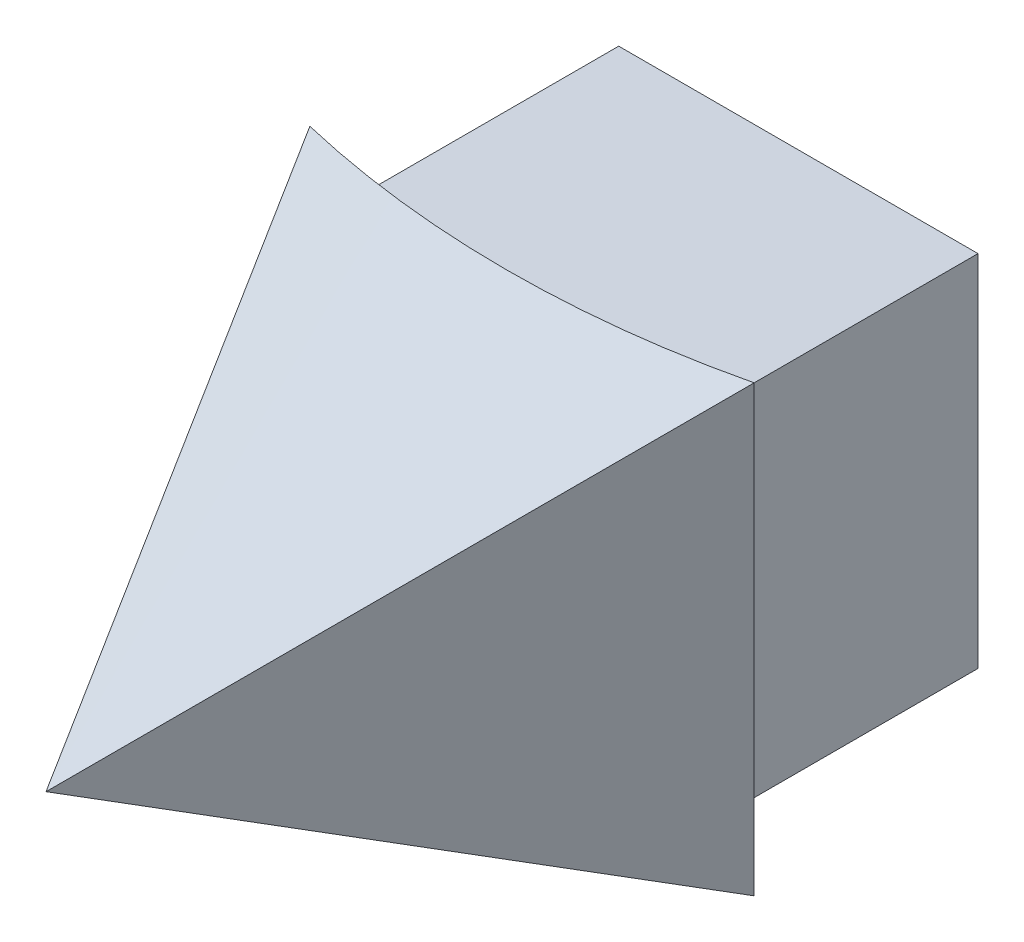
ISO-10303-21;
HEADER;
FILE_DESCRIPTION(('STEP AP214'),'2;1');
FILE_NAME('part.step','',(''),(''),'','','');
FILE_SCHEMA(('AUTOMOTIVE_DESIGN { 1 0 10303 214 1 1 1 1 }'));
ENDSEC;
DATA;
#1=APPLICATION_CONTEXT('core data for automotive mechanical design processes');
#2=APPLICATION_PROTOCOL_DEFINITION('international standard','automotive_design',2000,#1);
#3=PRODUCT_CONTEXT('',#1,'mechanical');
#4=PRODUCT('Part','Part','',(#3));
#5=PRODUCT_RELATED_PRODUCT_CATEGORY('part','',(#4));
#6=PRODUCT_DEFINITION_FORMATION('','',#4);
#7=PRODUCT_DEFINITION_CONTEXT('part definition',#1,'design');
#8=PRODUCT_DEFINITION('design','',#6,#7);
#9=PRODUCT_DEFINITION_SHAPE('','',#8);
#10=(LENGTH_UNIT() NAMED_UNIT(*) SI_UNIT(.MILLI.,.METRE.));
#11=(NAMED_UNIT(*) PLANE_ANGLE_UNIT() SI_UNIT($,.RADIAN.));
#12=(NAMED_UNIT(*) SI_UNIT($,.STERADIAN.) SOLID_ANGLE_UNIT());
#13=UNCERTAINTY_MEASURE_WITH_UNIT(LENGTH_MEASURE(1.E-05),#10,'distance_accuracy_value','');
#14=(GEOMETRIC_REPRESENTATION_CONTEXT(3) GLOBAL_UNCERTAINTY_ASSIGNED_CONTEXT((#13)) GLOBAL_UNIT_ASSIGNED_CONTEXT((#10,
#11,#12)) REPRESENTATION_CONTEXT('',''));
#15=CARTESIAN_POINT('',(0.,0.,0.));
#16=DIRECTION('',(0.,0.,1.));
#17=DIRECTION('',(1.,0.,0.));
#18=AXIS2_PLACEMENT_3D('',#15,#16,#17);
#19=CARTESIAN_POINT('',(0.,0.,0.));
#20=DIRECTION('',(0.,1.,0.));
#21=DIRECTION('',(0.,0.,1.));
#22=AXIS2_PLACEMENT_3D('',#19,#20,#21);
#23=CYLINDRICAL_SURFACE('',#22,41.2369);
#24=CARTESIAN_POINT('',(0.,46.6471,0.));
#25=DIRECTION('',(0.,1.,0.));
#26=DIRECTION('',(0.,0.,1.));
#27=AXIS2_PLACEMENT_3D('',#24,#25,#26);
#28=CIRCLE('',#27,41.2369);
#29=CARTESIAN_POINT('',(5.37210000000001,46.6471,40.8854798577686));
#30=VERTEX_POINT('',#29);
#31=CARTESIAN_POINT('',(-5.37210000000001,46.6471,40.8854798577686));
#32=VERTEX_POINT('',#31);
#33=EDGE_CURVE('E324',#30,#32,#28,.F.);
#34=ORIENTED_EDGE('',*,*,#33,.T.);
#35=DIRECTION('',(0.,1.,0.));
#36=VECTOR('',#35,1.);
#37=CARTESIAN_POINT('',(-5.37210000000001,0.,40.8854798577686));
#38=LINE('',#37,#36);
#39=CARTESIAN_POINT('',(-5.37210000000001,35.9029,40.8854798577686));
#40=VERTEX_POINT('',#39);
#41=EDGE_CURVE('E327',#32,#40,#38,.F.);
#42=ORIENTED_EDGE('',*,*,#41,.T.);
#43=CARTESIAN_POINT('',(0.,35.9029,0.));
#44=DIRECTION('',(0.,-1.,0.));
#45=DIRECTION('',(0.,0.,-1.));
#46=AXIS2_PLACEMENT_3D('',#43,#44,#45);
#47=CIRCLE('',#46,41.2369);
#48=CARTESIAN_POINT('',(5.37210000000001,35.9029,40.8854798577686));
#49=VERTEX_POINT('',#48);
#50=EDGE_CURVE('E318',#40,#49,#47,.F.);
#51=ORIENTED_EDGE('',*,*,#50,.T.);
#52=DIRECTION('',(0.,1.,0.));
#53=VECTOR('',#52,1.);
#54=CARTESIAN_POINT('',(5.37210000000001,0.,40.8854798577686));
#55=LINE('',#54,#53);
#56=EDGE_CURVE('E321',#49,#30,#55,.T.);
#57=ORIENTED_EDGE('',*,*,#56,.T.);
#58=EDGE_LOOP('',(#34,#42,#51,#57));
#59=FACE_BOUND('',#58,.T.);
#60=CARTESIAN_POINT('',(0.,34.08045,0.));
#61=DIRECTION('',(0.,-1.,0.));
#62=DIRECTION('',(0.,0.,-1.));
#63=AXIS2_PLACEMENT_3D('',#60,#61,#62);
#64=CIRCLE('',#63,41.2369);
#65=CARTESIAN_POINT('',(-7.19455,34.08045,40.6044378351369));
#66=VERTEX_POINT('',#65);
#67=CARTESIAN_POINT('',(7.19455,34.08045,40.6044378351369));
#68=VERTEX_POINT('',#67);
#69=EDGE_CURVE('E335',#66,#68,#64,.F.);
#70=ORIENTED_EDGE('',*,*,#69,.F.);
#71=DIRECTION('',(0.,1.,0.));
#72=VECTOR('',#71,1.);
#73=CARTESIAN_POINT('',(-7.19455,0.,40.6044378351369));
#74=LINE('',#73,#72);
#75=CARTESIAN_POINT('',(-7.19455,48.46955,40.6044378351369));
#76=VERTEX_POINT('',#75);
#77=EDGE_CURVE('E201',#76,#66,#74,.F.);
#78=ORIENTED_EDGE('',*,*,#77,.F.);
#79=CARTESIAN_POINT('',(0.,48.46955,0.));
#80=DIRECTION('',(0.,1.,0.));
#81=DIRECTION('',(0.,0.,1.));
#82=AXIS2_PLACEMENT_3D('',#79,#80,#81);
#83=CIRCLE('',#82,41.2369);
#84=CARTESIAN_POINT('',(7.19455,48.46955,40.6044378351369));
#85=VERTEX_POINT('',#84);
#86=EDGE_CURVE('E331',#85,#76,#83,.F.);
#87=ORIENTED_EDGE('',*,*,#86,.F.);
#88=DIRECTION('',(0.,1.,0.));
#89=VECTOR('',#88,1.);
#90=CARTESIAN_POINT('',(7.19455,0.,40.6044378351369));
#91=LINE('',#90,#89);
#92=EDGE_CURVE('E97',#68,#85,#91,.T.);
#93=ORIENTED_EDGE('',*,*,#92,.F.);
#94=EDGE_LOOP('',(#70,#78,#87,#93));
#95=FACE_BOUND('',#94,.T.);
#96=ADVANCED_FACE('F71',(#59,#95),#23,.F.);
#97=CARTESIAN_POINT('',(-5.37210000000001,35.9029,28.702));
#98=DIRECTION('',(-1.,0.,0.));
#99=DIRECTION('',(0.,0.,1.));
#100=AXIS2_PLACEMENT_3D('',#97,#98,#99);
#101=PLANE('',#100);
#102=ORIENTED_EDGE('',*,*,#41,.F.);
#103=DIRECTION('',(0.,0.,1.));
#104=VECTOR('',#103,1.);
#105=CARTESIAN_POINT('',(-5.37210000000001,46.6471,28.702));
#106=LINE('',#105,#104);
#107=CARTESIAN_POINT('',(-5.37210000000001,46.6471,28.702));
#108=VERTEX_POINT('',#107);
#109=EDGE_CURVE('E233',#108,#32,#106,.T.);
#110=ORIENTED_EDGE('',*,*,#109,.F.);
#111=DIRECTION('',(0.,-1.,0.));
#112=VECTOR('',#111,1.);
#113=CARTESIAN_POINT('',(-5.37210000000001,35.9029,28.702));
#114=LINE('',#113,#112);
#115=CARTESIAN_POINT('',(-5.37210000000001,35.9029,28.702));
#116=VERTEX_POINT('',#115);
#117=EDGE_CURVE('E219',#108,#116,#114,.T.);
#118=ORIENTED_EDGE('',*,*,#117,.T.);
#119=DIRECTION('',(0.,0.,1.));
#120=VECTOR('',#119,1.);
#121=CARTESIAN_POINT('',(-5.37210000000001,35.9029,28.702));
#122=LINE('',#121,#120);
#123=EDGE_CURVE('E232',#116,#40,#122,.T.);
#124=ORIENTED_EDGE('',*,*,#123,.T.);
#125=EDGE_LOOP('',(#102,#110,#118,#124));
#126=FACE_BOUND('',#125,.T.);
#127=ADVANCED_FACE('F266',(#126),#101,.T.);
#128=CARTESIAN_POINT('',(5.37210000000001,46.6471,28.702));
#129=DIRECTION('',(0.,1.,0.));
#130=DIRECTION('',(0.,0.,1.));
#131=AXIS2_PLACEMENT_3D('',#128,#129,#130);
#132=PLANE('',#131);
#133=ORIENTED_EDGE('',*,*,#33,.F.);
#134=DIRECTION('',(0.,0.,1.));
#135=VECTOR('',#134,1.);
#136=CARTESIAN_POINT('',(5.37210000000001,46.6471,28.702));
#137=LINE('',#136,#135);
#138=CARTESIAN_POINT('',(5.37210000000001,46.6471,28.702));
#139=VERTEX_POINT('',#138);
#140=EDGE_CURVE('E237',#139,#30,#137,.T.);
#141=ORIENTED_EDGE('',*,*,#140,.F.);
#142=DIRECTION('',(-1.,0.,0.));
#143=VECTOR('',#142,1.);
#144=CARTESIAN_POINT('',(5.37210000000001,46.6471,28.702));
#145=LINE('',#144,#143);
#146=EDGE_CURVE('E229',#139,#108,#145,.T.);
#147=ORIENTED_EDGE('',*,*,#146,.T.);
#148=ORIENTED_EDGE('',*,*,#109,.T.);
#149=EDGE_LOOP('',(#133,#141,#147,#148));
#150=FACE_BOUND('',#149,.T.);
#151=ADVANCED_FACE('F379',(#150),#132,.T.);
#152=CARTESIAN_POINT('',(5.37210000000001,35.9029,28.702));
#153=DIRECTION('',(1.,0.,0.));
#154=DIRECTION('',(0.,0.,-1.));
#155=AXIS2_PLACEMENT_3D('',#152,#153,#154);
#156=PLANE('',#155);
#157=ORIENTED_EDGE('',*,*,#56,.F.);
#158=DIRECTION('',(0.,0.,1.));
#159=VECTOR('',#158,1.);
#160=CARTESIAN_POINT('',(5.37210000000001,35.9029,28.702));
#161=LINE('',#160,#159);
#162=CARTESIAN_POINT('',(5.37210000000001,35.9029,28.702));
#163=VERTEX_POINT('',#162);
#164=EDGE_CURVE('E240',#163,#49,#161,.T.);
#165=ORIENTED_EDGE('',*,*,#164,.F.);
#166=DIRECTION('',(0.,1.,0.));
#167=VECTOR('',#166,1.);
#168=CARTESIAN_POINT('',(5.37210000000001,35.9029,28.702));
#169=LINE('',#168,#167);
#170=EDGE_CURVE('E226',#163,#139,#169,.T.);
#171=ORIENTED_EDGE('',*,*,#170,.T.);
#172=ORIENTED_EDGE('',*,*,#140,.T.);
#173=EDGE_LOOP('',(#157,#165,#171,#172));
#174=FACE_BOUND('',#173,.T.);
#175=ADVANCED_FACE('F384',(#174),#156,.T.);
#176=CARTESIAN_POINT('',(5.37210000000001,35.9029,28.702));
#177=DIRECTION('',(0.,-1.,0.));
#178=DIRECTION('',(0.,0.,-1.));
#179=AXIS2_PLACEMENT_3D('',#176,#177,#178);
#180=PLANE('',#179);
#181=ORIENTED_EDGE('',*,*,#50,.F.);
#182=ORIENTED_EDGE('',*,*,#123,.F.);
#183=DIRECTION('',(1.,0.,0.));
#184=VECTOR('',#183,1.);
#185=CARTESIAN_POINT('',(5.37210000000001,35.9029,28.702));
#186=LINE('',#185,#184);
#187=EDGE_CURVE('E222',#116,#163,#186,.T.);
#188=ORIENTED_EDGE('',*,*,#187,.T.);
#189=ORIENTED_EDGE('',*,*,#164,.T.);
#190=EDGE_LOOP('',(#181,#182,#188,#189));
#191=FACE_BOUND('',#190,.T.);
#192=ADVANCED_FACE('F392',(#191),#180,.T.);
#193=CARTESIAN_POINT('',(0.,0.,28.702));
#194=DIRECTION('',(0.,0.,1.));
#195=DIRECTION('',(1.,0.,0.));
#196=AXIS2_PLACEMENT_3D('',#193,#194,#195);
#197=PLANE('',#196);
#198=ORIENTED_EDGE('',*,*,#117,.F.);
#199=ORIENTED_EDGE('',*,*,#146,.F.);
#200=ORIENTED_EDGE('',*,*,#170,.F.);
#201=ORIENTED_EDGE('',*,*,#187,.F.);
#202=EDGE_LOOP('',(#198,#199,#200,#201));
#203=FACE_BOUND('',#202,.T.);
#204=ADVANCED_FACE('F390',(#203),#197,.F.);
#205=CARTESIAN_POINT('',(7.70255,33.57245,6.91589865028623));
#206=DIRECTION('',(0.,-1.,0.));
#207=DIRECTION('',(0.,0.,-1.));
#208=AXIS2_PLACEMENT_3D('',#205,#206,#207);
#209=PLANE('',#208);
#210=CARTESIAN_POINT('',(0.,33.57245,0.));
#211=DIRECTION('',(0.,-1.,0.));
#212=DIRECTION('',(0.,0.,-1.));
#213=AXIS2_PLACEMENT_3D('',#210,#211,#212);
#214=CIRCLE('',#213,41.2369);
#215=CARTESIAN_POINT('',(-7.70255,33.57245,40.5111422340509));
#216=VERTEX_POINT('',#215);
#217=CARTESIAN_POINT('',(7.70255,33.57245,40.5111422340509));
#218=VERTEX_POINT('',#217);
#219=EDGE_CURVE('E12',#216,#218,#214,.F.);
#220=ORIENTED_EDGE('',*,*,#219,.F.);
#221=DIRECTION('',(0.,0.,1.));
#222=VECTOR('',#221,1.);
#223=CARTESIAN_POINT('',(-7.70255,33.57245,6.91589865028623));
#224=LINE('',#223,#222);
#225=CARTESIAN_POINT('',(-7.70255,33.57245,28.702));
#226=VERTEX_POINT('',#225);
#227=EDGE_CURVE('E89',#226,#216,#224,.T.);
#228=ORIENTED_EDGE('',*,*,#227,.F.);
#229=DIRECTION('',(-1.,0.,0.));
#230=VECTOR('',#229,1.);
#231=CARTESIAN_POINT('',(7.70255,33.57245,28.702));
#232=LINE('',#231,#230);
#233=CARTESIAN_POINT('',(7.70255,33.57245,28.702));
#234=VERTEX_POINT('',#233);
#235=EDGE_CURVE('E223',#234,#226,#232,.T.);
#236=ORIENTED_EDGE('',*,*,#235,.F.);
#237=DIRECTION('',(0.,0.,1.));
#238=VECTOR('',#237,1.);
#239=CARTESIAN_POINT('',(7.70255,33.57245,6.91589865028623));
#240=LINE('',#239,#238);
#241=EDGE_CURVE('E349',#234,#218,#240,.T.);
#242=ORIENTED_EDGE('',*,*,#241,.T.);
#243=EDGE_LOOP('',(#220,#228,#236,#242));
#244=FACE_BOUND('',#243,.T.);
#245=ADVANCED_FACE('F353',(#244),#209,.T.);
#246=CARTESIAN_POINT('',(7.70255,33.57245,6.91589865028623));
#247=DIRECTION('',(1.,0.,0.));
#248=DIRECTION('',(0.,0.,-1.));
#249=AXIS2_PLACEMENT_3D('',#246,#247,#248);
#250=PLANE('',#249);
#251=DIRECTION('',(0.,1.,0.));
#252=VECTOR('',#251,1.);
#253=CARTESIAN_POINT('',(7.70254999999999,0.,40.5111422340509));
#254=LINE('',#253,#252);
#255=CARTESIAN_POINT('',(7.70254999999999,48.97755,40.5111422340509));
#256=VERTEX_POINT('',#255);
#257=EDGE_CURVE('E82',#218,#256,#254,.T.);
#258=ORIENTED_EDGE('',*,*,#257,.F.);
#259=ORIENTED_EDGE('',*,*,#241,.F.);
#260=DIRECTION('',(0.,-1.,0.));
#261=VECTOR('',#260,1.);
#262=CARTESIAN_POINT('',(7.70255,33.57245,28.702));
#263=LINE('',#262,#261);
#264=CARTESIAN_POINT('',(7.70255,48.97755,28.702));
#265=VERTEX_POINT('',#264);
#266=EDGE_CURVE('E208',#265,#234,#263,.T.);
#267=ORIENTED_EDGE('',*,*,#266,.F.);
#268=DIRECTION('',(0.,0.,1.));
#269=VECTOR('',#268,1.);
#270=CARTESIAN_POINT('',(7.70255,48.97755,6.91589865028623));
#271=LINE('',#270,#269);
#272=EDGE_CURVE('E214',#265,#256,#271,.T.);
#273=ORIENTED_EDGE('',*,*,#272,.T.);
#274=EDGE_LOOP('',(#258,#259,#267,#273));
#275=FACE_BOUND('',#274,.T.);
#276=ADVANCED_FACE('F347',(#275),#250,.T.);
#277=CARTESIAN_POINT('',(7.70255,48.97755,6.91589865028623));
#278=DIRECTION('',(0.,1.,0.));
#279=DIRECTION('',(0.,0.,1.));
#280=AXIS2_PLACEMENT_3D('',#277,#278,#279);
#281=PLANE('',#280);
#282=CARTESIAN_POINT('',(0.,48.97755,0.));
#283=DIRECTION('',(0.,1.,0.));
#284=DIRECTION('',(0.,0.,1.));
#285=AXIS2_PLACEMENT_3D('',#282,#283,#284);
#286=CIRCLE('',#285,41.2369);
#287=CARTESIAN_POINT('',(-7.70255,48.97755,40.5111422340509));
#288=VERTEX_POINT('',#287);
#289=EDGE_CURVE('E340',#256,#288,#286,.F.);
#290=ORIENTED_EDGE('',*,*,#289,.F.);
#291=ORIENTED_EDGE('',*,*,#272,.F.);
#292=DIRECTION('',(1.,0.,0.));
#293=VECTOR('',#292,1.);
#294=CARTESIAN_POINT('',(7.70255,48.97755,28.702));
#295=LINE('',#294,#293);
#296=CARTESIAN_POINT('',(-7.70255,48.97755,28.702));
#297=VERTEX_POINT('',#296);
#298=EDGE_CURVE('E211',#297,#265,#295,.T.);
#299=ORIENTED_EDGE('',*,*,#298,.F.);
#300=DIRECTION('',(0.,0.,1.));
#301=VECTOR('',#300,1.);
#302=CARTESIAN_POINT('',(-7.70255,48.97755,6.91589865028623));
#303=LINE('',#302,#301);
#304=EDGE_CURVE('E209',#297,#288,#303,.T.);
#305=ORIENTED_EDGE('',*,*,#304,.T.);
#306=EDGE_LOOP('',(#290,#291,#299,#305));
#307=FACE_BOUND('',#306,.T.);
#308=ADVANCED_FACE('F406',(#307),#281,.T.);
#309=CARTESIAN_POINT('',(-7.70255,33.57245,6.91589865028623));
#310=DIRECTION('',(-1.,0.,0.));
#311=DIRECTION('',(0.,0.,1.));
#312=AXIS2_PLACEMENT_3D('',#309,#310,#311);
#313=PLANE('',#312);
#314=DIRECTION('',(0.,1.,0.));
#315=VECTOR('',#314,1.);
#316=CARTESIAN_POINT('',(-7.70255,0.,40.5111422340509));
#317=LINE('',#316,#315);
#318=EDGE_CURVE('E337',#288,#216,#317,.F.);
#319=ORIENTED_EDGE('',*,*,#318,.F.);
#320=ORIENTED_EDGE('',*,*,#304,.F.);
#321=DIRECTION('',(0.,1.,0.));
#322=VECTOR('',#321,1.);
#323=CARTESIAN_POINT('',(-7.70255,33.57245,28.702));
#324=LINE('',#323,#322);
#325=EDGE_CURVE('E195',#226,#297,#324,.T.);
#326=ORIENTED_EDGE('',*,*,#325,.F.);
#327=ORIENTED_EDGE('',*,*,#227,.T.);
#328=EDGE_LOOP('',(#319,#320,#326,#327));
#329=FACE_BOUND('',#328,.T.);
#330=ADVANCED_FACE('F403',(#329),#313,.T.);
#331=CARTESIAN_POINT('',(7.19455,34.08045,6.91589865028623));
#332=DIRECTION('',(0.,-1.,0.));
#333=DIRECTION('',(0.,0.,-1.));
#334=AXIS2_PLACEMENT_3D('',#331,#332,#333);
#335=PLANE('',#334);
#336=DIRECTION('',(0.,0.,1.));
#337=VECTOR('',#336,1.);
#338=CARTESIAN_POINT('',(-7.19455,34.08045,6.91589865028623));
#339=LINE('',#338,#337);
#340=CARTESIAN_POINT('',(-7.19455,34.08045,28.702));
#341=VERTEX_POINT('',#340);
#342=EDGE_CURVE('E199',#341,#66,#339,.T.);
#343=ORIENTED_EDGE('',*,*,#342,.T.);
#344=ORIENTED_EDGE('',*,*,#69,.T.);
#345=DIRECTION('',(0.,0.,1.));
#346=VECTOR('',#345,1.);
#347=CARTESIAN_POINT('',(7.19455,34.08045,6.91589865028623));
#348=LINE('',#347,#346);
#349=CARTESIAN_POINT('',(7.19455,34.08045,28.702));
#350=VERTEX_POINT('',#349);
#351=EDGE_CURVE('E203',#350,#68,#348,.T.);
#352=ORIENTED_EDGE('',*,*,#351,.F.);
#353=DIRECTION('',(-1.,0.,0.));
#354=VECTOR('',#353,1.);
#355=CARTESIAN_POINT('',(7.19455,34.08045,28.702));
#356=LINE('',#355,#354);
#357=EDGE_CURVE('E188',#350,#341,#356,.T.);
#358=ORIENTED_EDGE('',*,*,#357,.T.);
#359=EDGE_LOOP('',(#343,#344,#352,#358));
#360=FACE_BOUND('',#359,.T.);
#361=ADVANCED_FACE('F206',(#360),#335,.F.);
#362=CARTESIAN_POINT('',(7.19455,34.08045,6.91589865028623));
#363=DIRECTION('',(1.,0.,0.));
#364=DIRECTION('',(0.,0.,-1.));
#365=AXIS2_PLACEMENT_3D('',#362,#363,#364);
#366=PLANE('',#365);
#367=ORIENTED_EDGE('',*,*,#351,.T.);
#368=ORIENTED_EDGE('',*,*,#92,.T.);
#369=DIRECTION('',(0.,0.,1.));
#370=VECTOR('',#369,1.);
#371=CARTESIAN_POINT('',(7.19455,48.46955,6.91589865028623));
#372=LINE('',#371,#370);
#373=CARTESIAN_POINT('',(7.19455,48.46955,28.702));
#374=VERTEX_POINT('',#373);
#375=EDGE_CURVE('E358',#374,#85,#372,.T.);
#376=ORIENTED_EDGE('',*,*,#375,.F.);
#377=DIRECTION('',(0.,-1.,0.));
#378=VECTOR('',#377,1.);
#379=CARTESIAN_POINT('',(7.19455,34.08045,28.702));
#380=LINE('',#379,#378);
#381=EDGE_CURVE('E364',#374,#350,#380,.T.);
#382=ORIENTED_EDGE('',*,*,#381,.T.);
#383=EDGE_LOOP('',(#367,#368,#376,#382));
#384=FACE_BOUND('',#383,.T.);
#385=ADVANCED_FACE('F369',(#384),#366,.F.);
#386=CARTESIAN_POINT('',(7.19455,48.46955,6.91589865028623));
#387=DIRECTION('',(0.,1.,0.));
#388=DIRECTION('',(0.,0.,1.));
#389=AXIS2_PLACEMENT_3D('',#386,#387,#388);
#390=PLANE('',#389);
#391=ORIENTED_EDGE('',*,*,#375,.T.);
#392=ORIENTED_EDGE('',*,*,#86,.T.);
#393=DIRECTION('',(0.,0.,1.));
#394=VECTOR('',#393,1.);
#395=CARTESIAN_POINT('',(-7.19455,48.46955,6.91589865028623));
#396=LINE('',#395,#394);
#397=CARTESIAN_POINT('',(-7.19455,48.46955,28.702));
#398=VERTEX_POINT('',#397);
#399=EDGE_CURVE('E355',#398,#76,#396,.T.);
#400=ORIENTED_EDGE('',*,*,#399,.F.);
#401=DIRECTION('',(1.,0.,0.));
#402=VECTOR('',#401,1.);
#403=CARTESIAN_POINT('',(7.19455,48.46955,28.702));
#404=LINE('',#403,#402);
#405=EDGE_CURVE('E191',#398,#374,#404,.T.);
#406=ORIENTED_EDGE('',*,*,#405,.T.);
#407=EDGE_LOOP('',(#391,#392,#400,#406));
#408=FACE_BOUND('',#407,.T.);
#409=ADVANCED_FACE('F371',(#408),#390,.F.);
#410=CARTESIAN_POINT('',(-7.19455,34.08045,6.91589865028623));
#411=DIRECTION('',(-1.,0.,0.));
#412=DIRECTION('',(0.,0.,1.));
#413=AXIS2_PLACEMENT_3D('',#410,#411,#412);
#414=PLANE('',#413);
#415=ORIENTED_EDGE('',*,*,#399,.T.);
#416=ORIENTED_EDGE('',*,*,#77,.T.);
#417=ORIENTED_EDGE('',*,*,#342,.F.);
#418=DIRECTION('',(0.,1.,0.));
#419=VECTOR('',#418,1.);
#420=CARTESIAN_POINT('',(-7.19455,34.08045,28.702));
#421=LINE('',#420,#419);
#422=EDGE_CURVE('E184',#341,#398,#421,.T.);
#423=ORIENTED_EDGE('',*,*,#422,.T.);
#424=EDGE_LOOP('',(#415,#416,#417,#423));
#425=FACE_BOUND('',#424,.T.);
#426=ADVANCED_FACE('F200',(#425),#414,.F.);
#427=CARTESIAN_POINT('',(0.,0.,28.702));
#428=DIRECTION('',(0.,0.,1.));
#429=DIRECTION('',(1.,0.,0.));
#430=AXIS2_PLACEMENT_3D('',#427,#428,#429);
#431=PLANE('',#430);
#432=ORIENTED_EDGE('',*,*,#325,.T.);
#433=ORIENTED_EDGE('',*,*,#298,.T.);
#434=ORIENTED_EDGE('',*,*,#266,.T.);
#435=ORIENTED_EDGE('',*,*,#235,.T.);
#436=EDGE_LOOP('',(#432,#433,#434,#435));
#437=FACE_BOUND('',#436,.T.);
#438=ORIENTED_EDGE('',*,*,#357,.F.);
#439=ORIENTED_EDGE('',*,*,#381,.F.);
#440=ORIENTED_EDGE('',*,*,#405,.F.);
#441=ORIENTED_EDGE('',*,*,#422,.F.);
#442=EDGE_LOOP('',(#438,#439,#440,#441));
#443=FACE_BOUND('',#442,.T.);
#444=ADVANCED_FACE('F186',(#437,#443),#431,.F.);
#445=CARTESIAN_POINT('',(9.52499999999999,50.8,40.1217683634458));
#446=CARTESIAN_POINT('',(0.,41.275,60.96));
#447=CARTESIAN_POINT('',(8.74567706897371,50.8,40.3067814179748));
#448=CARTESIAN_POINT('',(0.,41.275,60.96));
#449=CARTESIAN_POINT('',(7.17624752548362,50.8000000000001,40.6313833641646));
#450=CARTESIAN_POINT('',(0.,41.275,60.96));
#451=CARTESIAN_POINT('',(4.79774165931795,50.7999999999999,40.9803540739042));
#452=CARTESIAN_POINT('',(0.,41.275,60.96));
#453=CARTESIAN_POINT('',(2.4029494362443,50.8000000000001,41.1902133599667));
#454=CARTESIAN_POINT('',(0.,41.275,60.96));
#455=CARTESIAN_POINT('',(0.800983184074129,50.8,41.2369));
#456=CARTESIAN_POINT('',(0.,41.275,60.96));
#457=CARTESIAN_POINT('',(-0.800983184074144,50.8,41.2369));
#458=CARTESIAN_POINT('',(0.,41.275,60.96));
#459=CARTESIAN_POINT('',(-2.40294943624432,50.8000000000001,41.1902133599666));
#460=CARTESIAN_POINT('',(0.,41.275,60.96));
#461=CARTESIAN_POINT('',(-4.79774165931797,50.7999999999999,40.9803540739043));
#462=CARTESIAN_POINT('',(0.,41.275,60.96));
#463=CARTESIAN_POINT('',(-7.17624752548362,50.8,40.6313833641646));
#464=CARTESIAN_POINT('',(0.,41.275,60.96));
#465=CARTESIAN_POINT('',(-8.74567706897372,50.8,40.3067814179748));
#466=CARTESIAN_POINT('',(0.,41.275,60.96));
#467=CARTESIAN_POINT('',(-9.52500000000001,50.8,40.1217683634458));
#468=CARTESIAN_POINT('',(0.,41.275,60.96));
#469=B_SPLINE_SURFACE_WITH_KNOTS('',3,1,((#445,#446),(#447,#448),(#449,#450),(#451,#452),(#453,
#454),(#455,#456),(#457,#458),(#459,#460),(#461,#462),(#463,#464),(#465,#466),(#467,#468)),
.UNSPECIFIED.,.F.,.F.,.F.,(4,1,1,1,2,1,1,1,4),(2,2),(0.,0.125,0.25,0.375,0.5,0.625,0.75,0.875,
1.),(0.,1.),.UNSPECIFIED.);
#470=CARTESIAN_POINT('',(9.52499999999999,50.8,40.1217683634458));
#471=CARTESIAN_POINT('',(8.74567706897371,50.8,40.3067814179748));
#472=CARTESIAN_POINT('',(7.17624752548362,50.8000000000001,40.6313833641646));
#473=CARTESIAN_POINT('',(4.79774165931795,50.7999999999999,40.9803540739042));
#474=CARTESIAN_POINT('',(2.4029494362443,50.8000000000001,41.1902133599667));
#475=CARTESIAN_POINT('',(0.800983184074129,50.8,41.2369));
#476=CARTESIAN_POINT('',(-0.800983184074144,50.8,41.2369));
#477=CARTESIAN_POINT('',(-2.40294943624432,50.8000000000001,41.1902133599666));
#478=CARTESIAN_POINT('',(-4.79774165931797,50.7999999999999,40.9803540739043));
#479=CARTESIAN_POINT('',(-7.17624752548362,50.8,40.6313833641646));
#480=CARTESIAN_POINT('',(-8.74567706897372,50.8,40.3067814179748));
#481=CARTESIAN_POINT('',(-9.52500000000001,50.8,40.1217683634458));
#482=B_SPLINE_CURVE_WITH_KNOTS('',3,(#470,#471,#472,#473,#474,#475,#476,#477,#478,#479,#480,
#481),.UNSPECIFIED.,.F.,.F.,(4,1,1,1,2,1,1,1,4),(0.,0.125,0.25,0.375,0.5,0.625,0.75,0.875,1.),.UNSPECIFIED.);
#483=CARTESIAN_POINT('',(0.,50.8,41.2369));
#484=VERTEX_POINT('',#483);
#485=CARTESIAN_POINT('',(9.52499999999999,50.8,40.1217683634458));
#486=VERTEX_POINT('',#485);
#487=EDGE_CURVE('E304',#484,#486,#482,.F.);
#488=CARTESIAN_POINT('',(0.,50.8,0.));
#489=DIRECTION('',(0.,1.,0.));
#490=DIRECTION('',(1.,0.,0.));
#491=AXIS2_PLACEMENT_3D('',#488,#489,#490);
#492=CIRCLE('',#491,41.2369);
#493=CARTESIAN_POINT('',(-9.52500000000001,50.8,40.1217683634458));
#494=VERTEX_POINT('',#493);
#495=EDGE_CURVE('E296',#494,#484,#492,.T.);
#496=DIRECTION('',(0.383871925523331,-0.38387192552333,0.839812294259867));
#497=VECTOR('',#496,1.);
#498=CARTESIAN_POINT('',(-4.7625,46.0375,50.5408841817229));
#499=LINE('',#498,#497);
#500=CARTESIAN_POINT('',(0.,41.275,60.96));
#501=VERTEX_POINT('',#500);
#502=EDGE_CURVE('E454',#494,#501,#499,.T.);
#503=DIRECTION('',(0.38387192552333,0.38387192552333,-0.839812294259867));
#504=VECTOR('',#503,1.);
#505=CARTESIAN_POINT('',(4.7625,46.0375,50.5408841817229));
#506=LINE('',#505,#504);
#507=EDGE_CURVE('E442',#501,#486,#506,.T.);
#508=ORIENTED_EDGE('',*,*,#487,.F.);
#509=ORIENTED_EDGE('',*,*,#495,.F.);
#510=ORIENTED_EDGE('',*,*,#502,.T.);
#511=ORIENTED_EDGE('',*,*,#507,.T.);
#512=EDGE_LOOP('',(#508,#509,#510,#511));
#513=FACE_BOUND('',#512,.T.);
#514=ADVANCED_FACE('F268',(#513),#469,.T.);
#515=CARTESIAN_POINT('',(-9.525,50.8,40.1217683634458));
#516=DIRECTION('',(-0.909491782606579,0.,0.415721899075701));
#517=DIRECTION('',(0.,-1.,0.));
#518=AXIS2_PLACEMENT_3D('',#515,#516,#517);
#519=PLANE('',#518);
#520=DIRECTION('',(0.,1.,0.));
#521=VECTOR('',#520,1.);
#522=CARTESIAN_POINT('',(-9.525,50.8,40.1217683634458));
#523=LINE('',#522,#521);
#524=CARTESIAN_POINT('',(-9.525,31.75,40.1217683634458));
#525=VERTEX_POINT('',#524);
#526=EDGE_CURVE('E247',#525,#494,#523,.T.);
#527=ORIENTED_EDGE('',*,*,#526,.F.);
#528=DIRECTION('',(0.38387192552333,0.38387192552333,0.839812294259867));
#529=VECTOR('',#528,1.);
#530=CARTESIAN_POINT('',(-4.7625,36.5125,50.5408841817229));
#531=LINE('',#530,#529);
#532=EDGE_CURVE('E455',#525,#501,#531,.T.);
#533=ORIENTED_EDGE('',*,*,#532,.T.);
#534=ORIENTED_EDGE('',*,*,#502,.F.);
#535=EDGE_LOOP('',(#527,#533,#534));
#536=FACE_BOUND('',#535,.T.);
#537=ADVANCED_FACE('F427',(#536),#519,.T.);
#538=CARTESIAN_POINT('',(-9.525,31.75,40.1217683634458));
#539=CARTESIAN_POINT('',(0.,41.275,60.96));
#540=CARTESIAN_POINT('',(-8.74567706897372,31.75,40.3067814179748));
#541=CARTESIAN_POINT('',(0.,41.275,60.96));
#542=CARTESIAN_POINT('',(-7.17624752548362,31.75,40.6313833641646));
#543=CARTESIAN_POINT('',(0.,41.275,60.96));
#544=CARTESIAN_POINT('',(-4.79774165931796,31.7499999999999,40.9803540739042));
#545=CARTESIAN_POINT('',(0.,41.275,60.96));
#546=CARTESIAN_POINT('',(-2.40294943624431,31.75,41.1902133599667));
#547=CARTESIAN_POINT('',(0.,41.275,60.96));
#548=CARTESIAN_POINT('',(-0.800983184074137,31.75,41.2369));
#549=CARTESIAN_POINT('',(0.,41.275,60.96));
#550=CARTESIAN_POINT('',(0.800983184074137,31.75,41.2369));
#551=CARTESIAN_POINT('',(0.,41.275,60.96));
#552=CARTESIAN_POINT('',(2.40294943624431,31.75,41.1902133599667));
#553=CARTESIAN_POINT('',(0.,41.275,60.96));
#554=CARTESIAN_POINT('',(4.79774165931796,31.75,40.9803540739042));
#555=CARTESIAN_POINT('',(0.,41.275,60.96));
#556=CARTESIAN_POINT('',(7.17624752548363,31.75,40.6313833641646));
#557=CARTESIAN_POINT('',(0.,41.275,60.96));
#558=CARTESIAN_POINT('',(8.74567706897373,31.75,40.3067814179748));
#559=CARTESIAN_POINT('',(0.,41.275,60.96));
#560=CARTESIAN_POINT('',(9.52500000000001,31.75,40.1217683634458));
#561=CARTESIAN_POINT('',(0.,41.275,60.96));
#562=B_SPLINE_SURFACE_WITH_KNOTS('',3,1,((#538,#539),(#540,#541),(#542,#543),(#544,#545),(#546,
#547),(#548,#549),(#550,#551),(#552,#553),(#554,#555),(#556,#557),(#558,#559),(#560,#561)),
.UNSPECIFIED.,.F.,.F.,.F.,(4,1,1,1,2,1,1,1,4),(2,2),(0.,0.125,0.25,0.375,0.5,0.625,0.75,0.875,
1.),(0.,1.),.UNSPECIFIED.);
#563=CARTESIAN_POINT('',(0.,31.75,0.));
#564=DIRECTION('',(0.,-1.,0.));
#565=DIRECTION('',(0.,0.,1.));
#566=AXIS2_PLACEMENT_3D('',#563,#564,#565);
#567=CIRCLE('',#566,41.2369);
#568=CARTESIAN_POINT('',(0.,31.75,41.2369));
#569=VERTEX_POINT('',#568);
#570=EDGE_CURVE('E316',#569,#525,#567,.T.);
#571=CARTESIAN_POINT('',(0.,31.75,0.));
#572=DIRECTION('',(0.,-1.,0.));
#573=DIRECTION('',(0.,0.,1.));
#574=AXIS2_PLACEMENT_3D('',#571,#572,#573);
#575=CIRCLE('',#574,41.2369);
#576=CARTESIAN_POINT('',(9.52500000000001,31.75,40.1217683634458));
#577=VERTEX_POINT('',#576);
#578=EDGE_CURVE('E494',#577,#569,#575,.T.);
#579=DIRECTION('',(-0.38387192552333,0.38387192552333,0.839812294259867));
#580=VECTOR('',#579,1.);
#581=CARTESIAN_POINT('',(4.7625,36.5125,50.5408841817229));
#582=LINE('',#581,#580);
#583=EDGE_CURVE('E236',#577,#501,#582,.T.);
#584=ORIENTED_EDGE('',*,*,#570,.F.);
#585=ORIENTED_EDGE('',*,*,#578,.F.);
#586=ORIENTED_EDGE('',*,*,#583,.T.);
#587=ORIENTED_EDGE('',*,*,#532,.F.);
#588=EDGE_LOOP('',(#584,#585,#586,#587));
#589=FACE_BOUND('',#588,.T.);
#590=ADVANCED_FACE('F73',(#589),#562,.T.);
#591=CARTESIAN_POINT('',(9.525,31.75,40.1217683634458));
#592=DIRECTION('',(0.909491782606579,0.,0.415721899075701));
#593=DIRECTION('',(0.,1.,0.));
#594=AXIS2_PLACEMENT_3D('',#591,#592,#593);
#595=PLANE('',#594);
#596=DIRECTION('',(0.,-1.,0.));
#597=VECTOR('',#596,1.);
#598=CARTESIAN_POINT('',(9.525,50.8,40.1217683634458));
#599=LINE('',#598,#597);
#600=EDGE_CURVE('E461',#486,#577,#599,.T.);
#601=ORIENTED_EDGE('',*,*,#600,.F.);
#602=ORIENTED_EDGE('',*,*,#507,.F.);
#603=ORIENTED_EDGE('',*,*,#583,.F.);
#604=EDGE_LOOP('',(#601,#602,#603));
#605=FACE_BOUND('',#604,.T.);
#606=ADVANCED_FACE('F264',(#605),#595,.T.);
#607=ORIENTED_EDGE('',*,*,#318,.T.);
#608=ORIENTED_EDGE('',*,*,#219,.T.);
#609=ORIENTED_EDGE('',*,*,#257,.T.);
#610=ORIENTED_EDGE('',*,*,#289,.T.);
#611=EDGE_LOOP('',(#607,#608,#609,#610));
#612=FACE_BOUND('',#611,.T.);
#613=ORIENTED_EDGE('',*,*,#600,.T.);
#614=ORIENTED_EDGE('',*,*,#578,.T.);
#615=ORIENTED_EDGE('',*,*,#570,.T.);
#616=ORIENTED_EDGE('',*,*,#526,.T.);
#617=ORIENTED_EDGE('',*,*,#495,.T.);
#618=ORIENTED_EDGE('',*,*,#487,.T.);
#619=EDGE_LOOP('',(#613,#614,#615,#616,#617,#618));
#620=FACE_BOUND('',#619,.T.);
#621=ADVANCED_FACE('F254',(#612,#620),#23,.F.);
#622=CLOSED_SHELL('',(#96,#127,#151,#175,#192,#204,#245,#276,#308,#330,#361,#385,#409,#426,#444,
#514,#537,#590,#606,#621));
#623=MANIFOLD_SOLID_BREP('B2',#622);
#624=ADVANCED_BREP_SHAPE_REPRESENTATION('',(#18,#623),#14);
#625=SHAPE_DEFINITION_REPRESENTATION(#9,#624);
ENDSEC;
END-ISO-10303-21;
